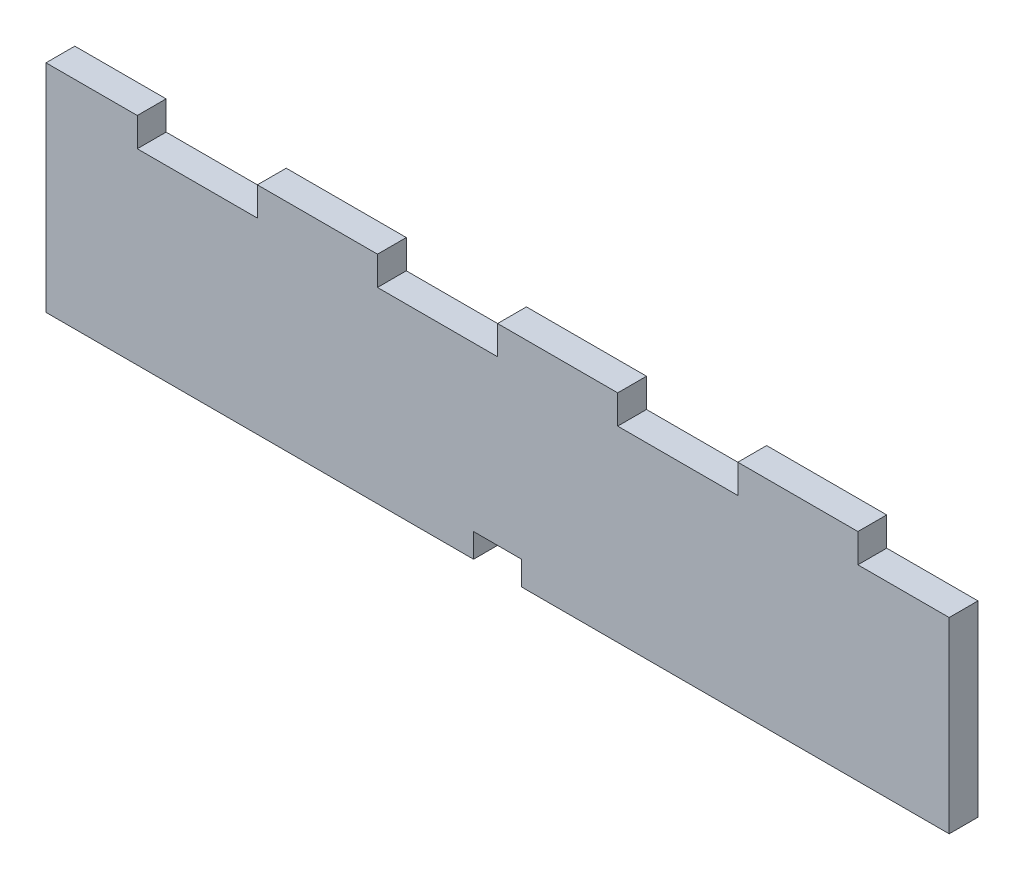
ISO-10303-21;
HEADER;
FILE_DESCRIPTION(('STEP AP214'),'2;1');
FILE_NAME('part.step','',(''),(''),'','','');
FILE_SCHEMA(('AUTOMOTIVE_DESIGN { 1 0 10303 214 1 1 1 1 }'));
ENDSEC;
DATA;
#1=APPLICATION_CONTEXT('core data for automotive mechanical design processes');
#2=APPLICATION_PROTOCOL_DEFINITION('international standard','automotive_design',2000,#1);
#3=PRODUCT_CONTEXT('',#1,'mechanical');
#4=PRODUCT('Part','Part','',(#3));
#5=PRODUCT_RELATED_PRODUCT_CATEGORY('part','',(#4));
#6=PRODUCT_DEFINITION_FORMATION('','',#4);
#7=PRODUCT_DEFINITION_CONTEXT('part definition',#1,'design');
#8=PRODUCT_DEFINITION('design','',#6,#7);
#9=PRODUCT_DEFINITION_SHAPE('','',#8);
#10=(LENGTH_UNIT() NAMED_UNIT(*) SI_UNIT(.MILLI.,.METRE.));
#11=(NAMED_UNIT(*) PLANE_ANGLE_UNIT() SI_UNIT($,.RADIAN.));
#12=(NAMED_UNIT(*) SI_UNIT($,.STERADIAN.) SOLID_ANGLE_UNIT());
#13=UNCERTAINTY_MEASURE_WITH_UNIT(LENGTH_MEASURE(1.E-05),#10,'distance_accuracy_value','');
#14=(GEOMETRIC_REPRESENTATION_CONTEXT(3) GLOBAL_UNCERTAINTY_ASSIGNED_CONTEXT((#13)) GLOBAL_UNIT_ASSIGNED_CONTEXT((#10,
#11,#12)) REPRESENTATION_CONTEXT('',''));
#15=CARTESIAN_POINT('',(0.,0.,0.));
#16=DIRECTION('',(0.,0.,1.));
#17=DIRECTION('',(1.,0.,0.));
#18=AXIS2_PLACEMENT_3D('',#15,#16,#17);
#19=CARTESIAN_POINT('',(0.,5.,6.));
#20=DIRECTION('',(0.,-1.,0.));
#21=DIRECTION('',(0.,0.,-1.));
#22=AXIS2_PLACEMENT_3D('',#19,#20,#21);
#23=PLANE('',#22);
#24=DIRECTION('',(-1.,0.,0.));
#25=VECTOR('',#24,1.);
#26=CARTESIAN_POINT('',(0.,5.,0.));
#27=LINE('',#26,#25);
#28=CARTESIAN_POINT('',(99.,5.,0.));
#29=VERTEX_POINT('',#28);
#30=CARTESIAN_POINT('',(89.,5.,0.));
#31=VERTEX_POINT('',#30);
#32=EDGE_CURVE('E225',#29,#31,#27,.T.);
#33=ORIENTED_EDGE('',*,*,#32,.F.);
#34=DIRECTION('',(0.,0.,-1.));
#35=VECTOR('',#34,1.);
#36=CARTESIAN_POINT('',(99.,5.,6.));
#37=LINE('',#36,#35);
#38=CARTESIAN_POINT('',(99.,5.,6.));
#39=VERTEX_POINT('',#38);
#40=EDGE_CURVE('E11',#39,#29,#37,.T.);
#41=ORIENTED_EDGE('',*,*,#40,.F.);
#42=DIRECTION('',(-1.,0.,0.));
#43=VECTOR('',#42,1.);
#44=CARTESIAN_POINT('',(0.,5.,6.));
#45=LINE('',#44,#43);
#46=CARTESIAN_POINT('',(89.,5.,6.));
#47=VERTEX_POINT('',#46);
#48=EDGE_CURVE('E308',#39,#47,#45,.T.);
#49=ORIENTED_EDGE('',*,*,#48,.T.);
#50=DIRECTION('',(0.,0.,-1.));
#51=VECTOR('',#50,1.);
#52=CARTESIAN_POINT('',(89.,5.,6.));
#53=LINE('',#52,#51);
#54=EDGE_CURVE('E58',#47,#31,#53,.T.);
#55=ORIENTED_EDGE('',*,*,#54,.T.);
#56=EDGE_LOOP('',(#33,#41,#49,#55));
#57=FACE_BOUND('',#56,.T.);
#58=ADVANCED_FACE('F41',(#57),#23,.T.);
#59=CARTESIAN_POINT('',(99.,0.,6.));
#60=DIRECTION('',(-1.,0.,0.));
#61=DIRECTION('',(0.,0.,1.));
#62=AXIS2_PLACEMENT_3D('',#59,#60,#61);
#63=PLANE('',#62);
#64=DIRECTION('',(0.,1.,0.));
#65=VECTOR('',#64,1.);
#66=CARTESIAN_POINT('',(99.,0.,0.));
#67=LINE('',#66,#65);
#68=CARTESIAN_POINT('',(99.,0.,0.));
#69=VERTEX_POINT('',#68);
#70=EDGE_CURVE('E228',#69,#29,#67,.T.);
#71=ORIENTED_EDGE('',*,*,#70,.F.);
#72=DIRECTION('',(0.,0.,-1.));
#73=VECTOR('',#72,1.);
#74=CARTESIAN_POINT('',(99.,0.,6.));
#75=LINE('',#74,#73);
#76=CARTESIAN_POINT('',(99.,0.,6.));
#77=VERTEX_POINT('',#76);
#78=EDGE_CURVE('E50',#77,#69,#75,.T.);
#79=ORIENTED_EDGE('',*,*,#78,.F.);
#80=DIRECTION('',(0.,1.,0.));
#81=VECTOR('',#80,1.);
#82=CARTESIAN_POINT('',(99.,0.,6.));
#83=LINE('',#82,#81);
#84=EDGE_CURVE('E378',#77,#39,#83,.T.);
#85=ORIENTED_EDGE('',*,*,#84,.T.);
#86=ORIENTED_EDGE('',*,*,#40,.T.);
#87=EDGE_LOOP('',(#71,#79,#85,#86));
#88=FACE_BOUND('',#87,.T.);
#89=ADVANCED_FACE('F377',(#88),#63,.T.);
#90=CARTESIAN_POINT('',(0.,0.,6.));
#91=DIRECTION('',(0.,1.,0.));
#92=DIRECTION('',(0.,0.,1.));
#93=AXIS2_PLACEMENT_3D('',#90,#91,#92);
#94=PLANE('',#93);
#95=DIRECTION('',(1.,0.,0.));
#96=VECTOR('',#95,1.);
#97=CARTESIAN_POINT('',(0.,0.,0.));
#98=LINE('',#97,#96);
#99=CARTESIAN_POINT('',(188.,0.,0.));
#100=VERTEX_POINT('',#99);
#101=EDGE_CURVE('E232',#69,#100,#98,.T.);
#102=ORIENTED_EDGE('',*,*,#101,.T.);
#103=DIRECTION('',(0.,0.,-1.));
#104=VECTOR('',#103,1.);
#105=CARTESIAN_POINT('',(188.,0.,6.));
#106=LINE('',#105,#104);
#107=CARTESIAN_POINT('',(188.,0.,6.));
#108=VERTEX_POINT('',#107);
#109=EDGE_CURVE('E360',#108,#100,#106,.T.);
#110=ORIENTED_EDGE('',*,*,#109,.F.);
#111=DIRECTION('',(1.,0.,0.));
#112=VECTOR('',#111,1.);
#113=CARTESIAN_POINT('',(0.,0.,6.));
#114=LINE('',#113,#112);
#115=EDGE_CURVE('E369',#77,#108,#114,.T.);
#116=ORIENTED_EDGE('',*,*,#115,.F.);
#117=ORIENTED_EDGE('',*,*,#78,.T.);
#118=EDGE_LOOP('',(#102,#110,#116,#117));
#119=FACE_BOUND('',#118,.T.);
#120=ADVANCED_FACE('F367',(#119),#94,.F.);
#121=CARTESIAN_POINT('',(188.,0.,6.));
#122=DIRECTION('',(-1.,0.,0.));
#123=DIRECTION('',(0.,0.,1.));
#124=AXIS2_PLACEMENT_3D('',#121,#122,#123);
#125=PLANE('',#124);
#126=DIRECTION('',(0.,1.,0.));
#127=VECTOR('',#126,1.);
#128=CARTESIAN_POINT('',(188.,0.,0.));
#129=LINE('',#128,#127);
#130=CARTESIAN_POINT('',(188.,39.0000037997371,0.));
#131=VERTEX_POINT('',#130);
#132=EDGE_CURVE('E235',#100,#131,#129,.T.);
#133=ORIENTED_EDGE('',*,*,#132,.T.);
#134=DIRECTION('',(0.,0.,-1.));
#135=VECTOR('',#134,1.);
#136=CARTESIAN_POINT('',(188.,39.0000037997371,6.));
#137=LINE('',#136,#135);
#138=CARTESIAN_POINT('',(188.,39.0000037997371,6.));
#139=VERTEX_POINT('',#138);
#140=EDGE_CURVE('E357',#139,#131,#137,.T.);
#141=ORIENTED_EDGE('',*,*,#140,.F.);
#142=DIRECTION('',(0.,1.,0.));
#143=VECTOR('',#142,1.);
#144=CARTESIAN_POINT('',(188.,0.,6.));
#145=LINE('',#144,#143);
#146=EDGE_CURVE('E675',#108,#139,#145,.T.);
#147=ORIENTED_EDGE('',*,*,#146,.F.);
#148=ORIENTED_EDGE('',*,*,#109,.T.);
#149=EDGE_LOOP('',(#133,#141,#147,#148));
#150=FACE_BOUND('',#149,.T.);
#151=ADVANCED_FACE('F396',(#150),#125,.F.);
#152=CARTESIAN_POINT('',(0.,39.0000037997371,6.));
#153=DIRECTION('',(0.,1.,0.));
#154=DIRECTION('',(0.,0.,1.));
#155=AXIS2_PLACEMENT_3D('',#152,#153,#154);
#156=PLANE('',#155);
#157=DIRECTION('',(1.,0.,0.));
#158=VECTOR('',#157,1.);
#159=CARTESIAN_POINT('',(0.,39.0000037997371,0.));
#160=LINE('',#159,#158);
#161=CARTESIAN_POINT('',(169.,39.0000037997371,0.));
#162=VERTEX_POINT('',#161);
#163=EDGE_CURVE('E239',#162,#131,#160,.T.);
#164=ORIENTED_EDGE('',*,*,#163,.F.);
#165=DIRECTION('',(0.,0.,-1.));
#166=VECTOR('',#165,1.);
#167=CARTESIAN_POINT('',(169.,39.0000037997371,6.));
#168=LINE('',#167,#166);
#169=CARTESIAN_POINT('',(169.,39.0000037997371,6.));
#170=VERTEX_POINT('',#169);
#171=EDGE_CURVE('E354',#170,#162,#168,.T.);
#172=ORIENTED_EDGE('',*,*,#171,.F.);
#173=DIRECTION('',(1.,0.,0.));
#174=VECTOR('',#173,1.);
#175=CARTESIAN_POINT('',(0.,39.0000037997371,6.));
#176=LINE('',#175,#174);
#177=EDGE_CURVE('E672',#170,#139,#176,.T.);
#178=ORIENTED_EDGE('',*,*,#177,.T.);
#179=ORIENTED_EDGE('',*,*,#140,.T.);
#180=EDGE_LOOP('',(#164,#172,#178,#179));
#181=FACE_BOUND('',#180,.T.);
#182=ADVANCED_FACE('F401',(#181),#156,.T.);
#183=CARTESIAN_POINT('',(169.,0.,6.));
#184=DIRECTION('',(-1.,0.,0.));
#185=DIRECTION('',(0.,0.,1.));
#186=AXIS2_PLACEMENT_3D('',#183,#184,#185);
#187=PLANE('',#186);
#188=DIRECTION('',(0.,1.,0.));
#189=VECTOR('',#188,1.);
#190=CARTESIAN_POINT('',(169.,0.,0.));
#191=LINE('',#190,#189);
#192=CARTESIAN_POINT('',(169.,45.0000037997371,0.));
#193=VERTEX_POINT('',#192);
#194=EDGE_CURVE('E243',#162,#193,#191,.T.);
#195=ORIENTED_EDGE('',*,*,#194,.T.);
#196=DIRECTION('',(0.,0.,-1.));
#197=VECTOR('',#196,1.);
#198=CARTESIAN_POINT('',(169.,45.0000037997371,6.));
#199=LINE('',#198,#197);
#200=CARTESIAN_POINT('',(169.,45.0000037997371,6.));
#201=VERTEX_POINT('',#200);
#202=EDGE_CURVE('E351',#201,#193,#199,.T.);
#203=ORIENTED_EDGE('',*,*,#202,.F.);
#204=DIRECTION('',(0.,1.,0.));
#205=VECTOR('',#204,1.);
#206=CARTESIAN_POINT('',(169.,0.,6.));
#207=LINE('',#206,#205);
#208=EDGE_CURVE('E669',#170,#201,#207,.T.);
#209=ORIENTED_EDGE('',*,*,#208,.F.);
#210=ORIENTED_EDGE('',*,*,#171,.T.);
#211=EDGE_LOOP('',(#195,#203,#209,#210));
#212=FACE_BOUND('',#211,.T.);
#213=ADVANCED_FACE('F405',(#212),#187,.F.);
#214=CARTESIAN_POINT('',(0.,45.0000037997371,6.));
#215=DIRECTION('',(0.,1.,0.));
#216=DIRECTION('',(0.,0.,1.));
#217=AXIS2_PLACEMENT_3D('',#214,#215,#216);
#218=PLANE('',#217);
#219=DIRECTION('',(1.,0.,0.));
#220=VECTOR('',#219,1.);
#221=CARTESIAN_POINT('',(0.,45.0000037997371,0.));
#222=LINE('',#221,#220);
#223=CARTESIAN_POINT('',(144.,45.0000037997371,0.));
#224=VERTEX_POINT('',#223);
#225=EDGE_CURVE('E247',#224,#193,#222,.T.);
#226=ORIENTED_EDGE('',*,*,#225,.F.);
#227=DIRECTION('',(0.,0.,-1.));
#228=VECTOR('',#227,1.);
#229=CARTESIAN_POINT('',(144.,45.0000037997371,6.));
#230=LINE('',#229,#228);
#231=CARTESIAN_POINT('',(144.,45.0000037997371,6.));
#232=VERTEX_POINT('',#231);
#233=EDGE_CURVE('E348',#232,#224,#230,.T.);
#234=ORIENTED_EDGE('',*,*,#233,.F.);
#235=DIRECTION('',(1.,0.,0.));
#236=VECTOR('',#235,1.);
#237=CARTESIAN_POINT('',(0.,45.0000037997371,6.));
#238=LINE('',#237,#236);
#239=EDGE_CURVE('E667',#232,#201,#238,.T.);
#240=ORIENTED_EDGE('',*,*,#239,.T.);
#241=ORIENTED_EDGE('',*,*,#202,.T.);
#242=EDGE_LOOP('',(#226,#234,#240,#241));
#243=FACE_BOUND('',#242,.T.);
#244=ADVANCED_FACE('F409',(#243),#218,.T.);
#245=CARTESIAN_POINT('',(144.,0.,6.));
#246=DIRECTION('',(-1.,0.,0.));
#247=DIRECTION('',(0.,0.,1.));
#248=AXIS2_PLACEMENT_3D('',#245,#246,#247);
#249=PLANE('',#248);
#250=DIRECTION('',(0.,1.,0.));
#251=VECTOR('',#250,1.);
#252=CARTESIAN_POINT('',(144.,0.,0.));
#253=LINE('',#252,#251);
#254=CARTESIAN_POINT('',(144.,39.0000037997371,0.));
#255=VERTEX_POINT('',#254);
#256=EDGE_CURVE('E251',#255,#224,#253,.T.);
#257=ORIENTED_EDGE('',*,*,#256,.F.);
#258=DIRECTION('',(0.,0.,-1.));
#259=VECTOR('',#258,1.);
#260=CARTESIAN_POINT('',(144.,39.0000037997371,6.));
#261=LINE('',#260,#259);
#262=CARTESIAN_POINT('',(144.,39.0000037997371,6.));
#263=VERTEX_POINT('',#262);
#264=EDGE_CURVE('E345',#263,#255,#261,.T.);
#265=ORIENTED_EDGE('',*,*,#264,.F.);
#266=DIRECTION('',(0.,1.,0.));
#267=VECTOR('',#266,1.);
#268=CARTESIAN_POINT('',(144.,0.,6.));
#269=LINE('',#268,#267);
#270=EDGE_CURVE('E688',#263,#232,#269,.T.);
#271=ORIENTED_EDGE('',*,*,#270,.T.);
#272=ORIENTED_EDGE('',*,*,#233,.T.);
#273=EDGE_LOOP('',(#257,#265,#271,#272));
#274=FACE_BOUND('',#273,.T.);
#275=ADVANCED_FACE('F413',(#274),#249,.T.);
#276=CARTESIAN_POINT('',(0.,39.0000037997371,6.));
#277=DIRECTION('',(0.,1.,0.));
#278=DIRECTION('',(0.,0.,1.));
#279=AXIS2_PLACEMENT_3D('',#276,#277,#278);
#280=PLANE('',#279);
#281=DIRECTION('',(1.,0.,0.));
#282=VECTOR('',#281,1.);
#283=CARTESIAN_POINT('',(0.,39.0000037997371,0.));
#284=LINE('',#283,#282);
#285=CARTESIAN_POINT('',(119.,39.0000037997371,0.));
#286=VERTEX_POINT('',#285);
#287=EDGE_CURVE('E255',#286,#255,#284,.T.);
#288=ORIENTED_EDGE('',*,*,#287,.F.);
#289=DIRECTION('',(0.,0.,-1.));
#290=VECTOR('',#289,1.);
#291=CARTESIAN_POINT('',(119.,39.0000037997371,6.));
#292=LINE('',#291,#290);
#293=CARTESIAN_POINT('',(119.,39.0000037997371,6.));
#294=VERTEX_POINT('',#293);
#295=EDGE_CURVE('E342',#294,#286,#292,.T.);
#296=ORIENTED_EDGE('',*,*,#295,.F.);
#297=DIRECTION('',(1.,0.,0.));
#298=VECTOR('',#297,1.);
#299=CARTESIAN_POINT('',(0.,39.0000037997371,6.));
#300=LINE('',#299,#298);
#301=EDGE_CURVE('E658',#294,#263,#300,.T.);
#302=ORIENTED_EDGE('',*,*,#301,.T.);
#303=ORIENTED_EDGE('',*,*,#264,.T.);
#304=EDGE_LOOP('',(#288,#296,#302,#303));
#305=FACE_BOUND('',#304,.T.);
#306=ADVANCED_FACE('F417',(#305),#280,.T.);
#307=CARTESIAN_POINT('',(119.,0.,6.));
#308=DIRECTION('',(-1.,0.,0.));
#309=DIRECTION('',(0.,0.,1.));
#310=AXIS2_PLACEMENT_3D('',#307,#308,#309);
#311=PLANE('',#310);
#312=DIRECTION('',(0.,1.,0.));
#313=VECTOR('',#312,1.);
#314=CARTESIAN_POINT('',(119.,0.,0.));
#315=LINE('',#314,#313);
#316=CARTESIAN_POINT('',(119.,45.0000037997371,0.));
#317=VERTEX_POINT('',#316);
#318=EDGE_CURVE('E259',#286,#317,#315,.T.);
#319=ORIENTED_EDGE('',*,*,#318,.T.);
#320=DIRECTION('',(0.,0.,-1.));
#321=VECTOR('',#320,1.);
#322=CARTESIAN_POINT('',(119.,45.0000037997371,6.));
#323=LINE('',#322,#321);
#324=CARTESIAN_POINT('',(119.,45.0000037997371,6.));
#325=VERTEX_POINT('',#324);
#326=EDGE_CURVE('E339',#325,#317,#323,.T.);
#327=ORIENTED_EDGE('',*,*,#326,.F.);
#328=DIRECTION('',(0.,1.,0.));
#329=VECTOR('',#328,1.);
#330=CARTESIAN_POINT('',(119.,0.,6.));
#331=LINE('',#330,#329);
#332=EDGE_CURVE('E693',#294,#325,#331,.T.);
#333=ORIENTED_EDGE('',*,*,#332,.F.);
#334=ORIENTED_EDGE('',*,*,#295,.T.);
#335=EDGE_LOOP('',(#319,#327,#333,#334));
#336=FACE_BOUND('',#335,.T.);
#337=ADVANCED_FACE('F421',(#336),#311,.F.);
#338=CARTESIAN_POINT('',(0.,45.0000037997371,6.));
#339=DIRECTION('',(0.,1.,0.));
#340=DIRECTION('',(0.,0.,1.));
#341=AXIS2_PLACEMENT_3D('',#338,#339,#340);
#342=PLANE('',#341);
#343=DIRECTION('',(1.,0.,0.));
#344=VECTOR('',#343,1.);
#345=CARTESIAN_POINT('',(0.,45.0000037997371,0.));
#346=LINE('',#345,#344);
#347=CARTESIAN_POINT('',(94.,45.0000037997371,0.));
#348=VERTEX_POINT('',#347);
#349=EDGE_CURVE('E263',#348,#317,#346,.T.);
#350=ORIENTED_EDGE('',*,*,#349,.F.);
#351=DIRECTION('',(0.,0.,-1.));
#352=VECTOR('',#351,1.);
#353=CARTESIAN_POINT('',(94.,45.0000037997371,6.));
#354=LINE('',#353,#352);
#355=CARTESIAN_POINT('',(94.,45.0000037997371,6.));
#356=VERTEX_POINT('',#355);
#357=EDGE_CURVE('E336',#356,#348,#354,.T.);
#358=ORIENTED_EDGE('',*,*,#357,.F.);
#359=DIRECTION('',(1.,0.,0.));
#360=VECTOR('',#359,1.);
#361=CARTESIAN_POINT('',(0.,45.0000037997371,6.));
#362=LINE('',#361,#360);
#363=EDGE_CURVE('E652',#356,#325,#362,.T.);
#364=ORIENTED_EDGE('',*,*,#363,.T.);
#365=ORIENTED_EDGE('',*,*,#326,.T.);
#366=EDGE_LOOP('',(#350,#358,#364,#365));
#367=FACE_BOUND('',#366,.T.);
#368=ADVANCED_FACE('F425',(#367),#342,.T.);
#369=CARTESIAN_POINT('',(94.,0.,6.));
#370=DIRECTION('',(-1.,0.,0.));
#371=DIRECTION('',(0.,0.,1.));
#372=AXIS2_PLACEMENT_3D('',#369,#370,#371);
#373=PLANE('',#372);
#374=DIRECTION('',(0.,1.,0.));
#375=VECTOR('',#374,1.);
#376=CARTESIAN_POINT('',(94.,0.,0.));
#377=LINE('',#376,#375);
#378=CARTESIAN_POINT('',(94.,39.0000037997371,0.));
#379=VERTEX_POINT('',#378);
#380=EDGE_CURVE('E267',#379,#348,#377,.T.);
#381=ORIENTED_EDGE('',*,*,#380,.F.);
#382=DIRECTION('',(0.,0.,-1.));
#383=VECTOR('',#382,1.);
#384=CARTESIAN_POINT('',(94.,39.0000037997371,6.));
#385=LINE('',#384,#383);
#386=CARTESIAN_POINT('',(94.,39.0000037997371,6.));
#387=VERTEX_POINT('',#386);
#388=EDGE_CURVE('E333',#387,#379,#385,.T.);
#389=ORIENTED_EDGE('',*,*,#388,.F.);
#390=DIRECTION('',(0.,1.,0.));
#391=VECTOR('',#390,1.);
#392=CARTESIAN_POINT('',(94.,0.,6.));
#393=LINE('',#392,#391);
#394=EDGE_CURVE('E648',#387,#356,#393,.T.);
#395=ORIENTED_EDGE('',*,*,#394,.T.);
#396=ORIENTED_EDGE('',*,*,#357,.T.);
#397=EDGE_LOOP('',(#381,#389,#395,#396));
#398=FACE_BOUND('',#397,.T.);
#399=ADVANCED_FACE('F429',(#398),#373,.T.);
#400=CARTESIAN_POINT('',(0.,39.0000037997371,6.));
#401=DIRECTION('',(0.,1.,0.));
#402=DIRECTION('',(0.,0.,1.));
#403=AXIS2_PLACEMENT_3D('',#400,#401,#402);
#404=PLANE('',#403);
#405=DIRECTION('',(1.,0.,0.));
#406=VECTOR('',#405,1.);
#407=CARTESIAN_POINT('',(0.,39.0000037997371,0.));
#408=LINE('',#407,#406);
#409=CARTESIAN_POINT('',(69.,39.0000037997371,0.));
#410=VERTEX_POINT('',#409);
#411=EDGE_CURVE('E271',#410,#379,#408,.T.);
#412=ORIENTED_EDGE('',*,*,#411,.F.);
#413=DIRECTION('',(0.,0.,-1.));
#414=VECTOR('',#413,1.);
#415=CARTESIAN_POINT('',(69.,39.0000037997371,6.));
#416=LINE('',#415,#414);
#417=CARTESIAN_POINT('',(69.,39.0000037997371,6.));
#418=VERTEX_POINT('',#417);
#419=EDGE_CURVE('E330',#418,#410,#416,.T.);
#420=ORIENTED_EDGE('',*,*,#419,.F.);
#421=DIRECTION('',(1.,0.,0.));
#422=VECTOR('',#421,1.);
#423=CARTESIAN_POINT('',(0.,39.0000037997371,6.));
#424=LINE('',#423,#422);
#425=EDGE_CURVE('E642',#418,#387,#424,.T.);
#426=ORIENTED_EDGE('',*,*,#425,.T.);
#427=ORIENTED_EDGE('',*,*,#388,.T.);
#428=EDGE_LOOP('',(#412,#420,#426,#427));
#429=FACE_BOUND('',#428,.T.);
#430=ADVANCED_FACE('F433',(#429),#404,.T.);
#431=CARTESIAN_POINT('',(69.,0.,6.));
#432=DIRECTION('',(-1.,0.,0.));
#433=DIRECTION('',(0.,0.,1.));
#434=AXIS2_PLACEMENT_3D('',#431,#432,#433);
#435=PLANE('',#434);
#436=DIRECTION('',(0.,1.,0.));
#437=VECTOR('',#436,1.);
#438=CARTESIAN_POINT('',(69.,0.,0.));
#439=LINE('',#438,#437);
#440=CARTESIAN_POINT('',(69.,45.0000037997371,0.));
#441=VERTEX_POINT('',#440);
#442=EDGE_CURVE('E275',#410,#441,#439,.T.);
#443=ORIENTED_EDGE('',*,*,#442,.T.);
#444=DIRECTION('',(0.,0.,-1.));
#445=VECTOR('',#444,1.);
#446=CARTESIAN_POINT('',(69.,45.0000037997371,6.));
#447=LINE('',#446,#445);
#448=CARTESIAN_POINT('',(69.,45.0000037997371,6.));
#449=VERTEX_POINT('',#448);
#450=EDGE_CURVE('E327',#449,#441,#447,.T.);
#451=ORIENTED_EDGE('',*,*,#450,.F.);
#452=DIRECTION('',(0.,1.,0.));
#453=VECTOR('',#452,1.);
#454=CARTESIAN_POINT('',(69.,0.,6.));
#455=LINE('',#454,#453);
#456=EDGE_CURVE('E639',#418,#449,#455,.T.);
#457=ORIENTED_EDGE('',*,*,#456,.F.);
#458=ORIENTED_EDGE('',*,*,#419,.T.);
#459=EDGE_LOOP('',(#443,#451,#457,#458));
#460=FACE_BOUND('',#459,.T.);
#461=ADVANCED_FACE('F437',(#460),#435,.F.);
#462=CARTESIAN_POINT('',(0.,45.0000037997371,6.));
#463=DIRECTION('',(0.,1.,0.));
#464=DIRECTION('',(0.,0.,1.));
#465=AXIS2_PLACEMENT_3D('',#462,#463,#464);
#466=PLANE('',#465);
#467=DIRECTION('',(1.,0.,0.));
#468=VECTOR('',#467,1.);
#469=CARTESIAN_POINT('',(0.,45.0000037997371,0.));
#470=LINE('',#469,#468);
#471=CARTESIAN_POINT('',(44.,45.0000037997371,0.));
#472=VERTEX_POINT('',#471);
#473=EDGE_CURVE('E279',#472,#441,#470,.T.);
#474=ORIENTED_EDGE('',*,*,#473,.F.);
#475=DIRECTION('',(0.,0.,-1.));
#476=VECTOR('',#475,1.);
#477=CARTESIAN_POINT('',(44.,45.0000037997371,6.));
#478=LINE('',#477,#476);
#479=CARTESIAN_POINT('',(44.,45.0000037997371,6.));
#480=VERTEX_POINT('',#479);
#481=EDGE_CURVE('E324',#480,#472,#478,.T.);
#482=ORIENTED_EDGE('',*,*,#481,.F.);
#483=DIRECTION('',(1.,0.,0.));
#484=VECTOR('',#483,1.);
#485=CARTESIAN_POINT('',(0.,45.0000037997371,6.));
#486=LINE('',#485,#484);
#487=EDGE_CURVE('E637',#480,#449,#486,.T.);
#488=ORIENTED_EDGE('',*,*,#487,.T.);
#489=ORIENTED_EDGE('',*,*,#450,.T.);
#490=EDGE_LOOP('',(#474,#482,#488,#489));
#491=FACE_BOUND('',#490,.T.);
#492=ADVANCED_FACE('F441',(#491),#466,.T.);
#493=CARTESIAN_POINT('',(44.,0.,6.));
#494=DIRECTION('',(-1.,0.,0.));
#495=DIRECTION('',(0.,0.,1.));
#496=AXIS2_PLACEMENT_3D('',#493,#494,#495);
#497=PLANE('',#496);
#498=DIRECTION('',(0.,1.,0.));
#499=VECTOR('',#498,1.);
#500=CARTESIAN_POINT('',(44.,0.,0.));
#501=LINE('',#500,#499);
#502=CARTESIAN_POINT('',(44.,39.0000037997371,0.));
#503=VERTEX_POINT('',#502);
#504=EDGE_CURVE('E283',#503,#472,#501,.T.);
#505=ORIENTED_EDGE('',*,*,#504,.F.);
#506=DIRECTION('',(0.,0.,-1.));
#507=VECTOR('',#506,1.);
#508=CARTESIAN_POINT('',(44.,39.0000037997371,6.));
#509=LINE('',#508,#507);
#510=CARTESIAN_POINT('',(44.,39.0000037997371,6.));
#511=VERTEX_POINT('',#510);
#512=EDGE_CURVE('E321',#511,#503,#509,.T.);
#513=ORIENTED_EDGE('',*,*,#512,.F.);
#514=DIRECTION('',(0.,1.,0.));
#515=VECTOR('',#514,1.);
#516=CARTESIAN_POINT('',(44.,0.,6.));
#517=LINE('',#516,#515);
#518=EDGE_CURVE('E706',#511,#480,#517,.T.);
#519=ORIENTED_EDGE('',*,*,#518,.T.);
#520=ORIENTED_EDGE('',*,*,#481,.T.);
#521=EDGE_LOOP('',(#505,#513,#519,#520));
#522=FACE_BOUND('',#521,.T.);
#523=ADVANCED_FACE('F445',(#522),#497,.T.);
#524=CARTESIAN_POINT('',(0.,39.0000037997371,6.));
#525=DIRECTION('',(0.,1.,0.));
#526=DIRECTION('',(0.,0.,1.));
#527=AXIS2_PLACEMENT_3D('',#524,#525,#526);
#528=PLANE('',#527);
#529=DIRECTION('',(1.,0.,0.));
#530=VECTOR('',#529,1.);
#531=CARTESIAN_POINT('',(0.,39.0000037997371,0.));
#532=LINE('',#531,#530);
#533=CARTESIAN_POINT('',(19.,39.0000037997371,0.));
#534=VERTEX_POINT('',#533);
#535=EDGE_CURVE('E287',#534,#503,#532,.T.);
#536=ORIENTED_EDGE('',*,*,#535,.F.);
#537=DIRECTION('',(0.,0.,-1.));
#538=VECTOR('',#537,1.);
#539=CARTESIAN_POINT('',(19.,39.0000037997371,6.));
#540=LINE('',#539,#538);
#541=CARTESIAN_POINT('',(19.,39.0000037997371,6.));
#542=VERTEX_POINT('',#541);
#543=EDGE_CURVE('E318',#542,#534,#540,.T.);
#544=ORIENTED_EDGE('',*,*,#543,.F.);
#545=DIRECTION('',(1.,0.,0.));
#546=VECTOR('',#545,1.);
#547=CARTESIAN_POINT('',(0.,39.0000037997371,6.));
#548=LINE('',#547,#546);
#549=EDGE_CURVE('E628',#542,#511,#548,.T.);
#550=ORIENTED_EDGE('',*,*,#549,.T.);
#551=ORIENTED_EDGE('',*,*,#512,.T.);
#552=EDGE_LOOP('',(#536,#544,#550,#551));
#553=FACE_BOUND('',#552,.T.);
#554=ADVANCED_FACE('F449',(#553),#528,.T.);
#555=CARTESIAN_POINT('',(19.,0.,6.));
#556=DIRECTION('',(-1.,0.,0.));
#557=DIRECTION('',(0.,0.,1.));
#558=AXIS2_PLACEMENT_3D('',#555,#556,#557);
#559=PLANE('',#558);
#560=DIRECTION('',(0.,1.,0.));
#561=VECTOR('',#560,1.);
#562=CARTESIAN_POINT('',(19.,0.,0.));
#563=LINE('',#562,#561);
#564=CARTESIAN_POINT('',(19.,45.,0.));
#565=VERTEX_POINT('',#564);
#566=EDGE_CURVE('E291',#534,#565,#563,.T.);
#567=ORIENTED_EDGE('',*,*,#566,.T.);
#568=DIRECTION('',(0.,0.,-1.));
#569=VECTOR('',#568,1.);
#570=CARTESIAN_POINT('',(19.,45.,6.));
#571=LINE('',#570,#569);
#572=CARTESIAN_POINT('',(19.,45.,6.));
#573=VERTEX_POINT('',#572);
#574=EDGE_CURVE('E315',#573,#565,#571,.T.);
#575=ORIENTED_EDGE('',*,*,#574,.F.);
#576=DIRECTION('',(0.,1.,0.));
#577=VECTOR('',#576,1.);
#578=CARTESIAN_POINT('',(19.,0.,6.));
#579=LINE('',#578,#577);
#580=EDGE_CURVE('E219',#542,#573,#579,.T.);
#581=ORIENTED_EDGE('',*,*,#580,.F.);
#582=ORIENTED_EDGE('',*,*,#543,.T.);
#583=EDGE_LOOP('',(#567,#575,#581,#582));
#584=FACE_BOUND('',#583,.T.);
#585=ADVANCED_FACE('F453',(#584),#559,.F.);
#586=CARTESIAN_POINT('',(0.,45.,6.));
#587=DIRECTION('',(0.,1.,0.));
#588=DIRECTION('',(0.,0.,1.));
#589=AXIS2_PLACEMENT_3D('',#586,#587,#588);
#590=PLANE('',#589);
#591=DIRECTION('',(1.,0.,0.));
#592=VECTOR('',#591,1.);
#593=CARTESIAN_POINT('',(0.,45.,0.));
#594=LINE('',#593,#592);
#595=CARTESIAN_POINT('',(0.,45.,0.));
#596=VERTEX_POINT('',#595);
#597=EDGE_CURVE('E295',#596,#565,#594,.T.);
#598=ORIENTED_EDGE('',*,*,#597,.F.);
#599=DIRECTION('',(0.,0.,-1.));
#600=VECTOR('',#599,1.);
#601=CARTESIAN_POINT('',(0.,45.,6.));
#602=LINE('',#601,#600);
#603=CARTESIAN_POINT('',(0.,45.,6.));
#604=VERTEX_POINT('',#603);
#605=EDGE_CURVE('E203',#604,#596,#602,.T.);
#606=ORIENTED_EDGE('',*,*,#605,.F.);
#607=DIRECTION('',(1.,0.,0.));
#608=VECTOR('',#607,1.);
#609=CARTESIAN_POINT('',(0.,45.,6.));
#610=LINE('',#609,#608);
#611=EDGE_CURVE('E215',#604,#573,#610,.T.);
#612=ORIENTED_EDGE('',*,*,#611,.T.);
#613=ORIENTED_EDGE('',*,*,#574,.T.);
#614=EDGE_LOOP('',(#598,#606,#612,#613));
#615=FACE_BOUND('',#614,.T.);
#616=ADVANCED_FACE('F457',(#615),#590,.T.);
#617=CARTESIAN_POINT('',(0.,0.,6.));
#618=DIRECTION('',(-1.,0.,0.));
#619=DIRECTION('',(0.,0.,1.));
#620=AXIS2_PLACEMENT_3D('',#617,#618,#619);
#621=PLANE('',#620);
#622=DIRECTION('',(0.,1.,0.));
#623=VECTOR('',#622,1.);
#624=CARTESIAN_POINT('',(0.,0.,0.));
#625=LINE('',#624,#623);
#626=CARTESIAN_POINT('',(0.,0.,0.));
#627=VERTEX_POINT('',#626);
#628=EDGE_CURVE('E199',#627,#596,#625,.T.);
#629=ORIENTED_EDGE('',*,*,#628,.F.);
#630=DIRECTION('',(0.,0.,-1.));
#631=VECTOR('',#630,1.);
#632=CARTESIAN_POINT('',(0.,0.,6.));
#633=LINE('',#632,#631);
#634=CARTESIAN_POINT('',(0.,0.,6.));
#635=VERTEX_POINT('',#634);
#636=EDGE_CURVE('E193',#635,#627,#633,.T.);
#637=ORIENTED_EDGE('',*,*,#636,.F.);
#638=DIRECTION('',(0.,1.,0.));
#639=VECTOR('',#638,1.);
#640=CARTESIAN_POINT('',(0.,0.,6.));
#641=LINE('',#640,#639);
#642=EDGE_CURVE('E197',#635,#604,#641,.T.);
#643=ORIENTED_EDGE('',*,*,#642,.T.);
#644=ORIENTED_EDGE('',*,*,#605,.T.);
#645=EDGE_LOOP('',(#629,#637,#643,#644));
#646=FACE_BOUND('',#645,.T.);
#647=ADVANCED_FACE('F195',(#646),#621,.T.);
#648=CARTESIAN_POINT('',(0.,0.,6.));
#649=DIRECTION('',(0.,1.,0.));
#650=DIRECTION('',(0.,0.,1.));
#651=AXIS2_PLACEMENT_3D('',#648,#649,#650);
#652=PLANE('',#651);
#653=DIRECTION('',(1.,0.,0.));
#654=VECTOR('',#653,1.);
#655=CARTESIAN_POINT('',(0.,0.,0.));
#656=LINE('',#655,#654);
#657=CARTESIAN_POINT('',(89.,0.,0.));
#658=VERTEX_POINT('',#657);
#659=EDGE_CURVE('E301',#627,#658,#656,.T.);
#660=ORIENTED_EDGE('',*,*,#659,.T.);
#661=DIRECTION('',(0.,0.,-1.));
#662=VECTOR('',#661,1.);
#663=CARTESIAN_POINT('',(89.,0.,6.));
#664=LINE('',#663,#662);
#665=CARTESIAN_POINT('',(89.,0.,6.));
#666=VERTEX_POINT('',#665);
#667=EDGE_CURVE('E126',#666,#658,#664,.T.);
#668=ORIENTED_EDGE('',*,*,#667,.F.);
#669=DIRECTION('',(1.,0.,0.));
#670=VECTOR('',#669,1.);
#671=CARTESIAN_POINT('',(0.,0.,6.));
#672=LINE('',#671,#670);
#673=EDGE_CURVE('E205',#635,#666,#672,.T.);
#674=ORIENTED_EDGE('',*,*,#673,.F.);
#675=ORIENTED_EDGE('',*,*,#636,.T.);
#676=EDGE_LOOP('',(#660,#668,#674,#675));
#677=FACE_BOUND('',#676,.T.);
#678=ADVANCED_FACE('F206',(#677),#652,.F.);
#679=CARTESIAN_POINT('',(89.,0.,6.));
#680=DIRECTION('',(1.,0.,0.));
#681=DIRECTION('',(0.,0.,-1.));
#682=AXIS2_PLACEMENT_3D('',#679,#680,#681);
#683=PLANE('',#682);
#684=DIRECTION('',(0.,-1.,0.));
#685=VECTOR('',#684,1.);
#686=CARTESIAN_POINT('',(89.,0.,0.));
#687=LINE('',#686,#685);
#688=EDGE_CURVE('E304',#31,#658,#687,.T.);
#689=ORIENTED_EDGE('',*,*,#688,.F.);
#690=ORIENTED_EDGE('',*,*,#54,.F.);
#691=DIRECTION('',(0.,-1.,0.));
#692=VECTOR('',#691,1.);
#693=CARTESIAN_POINT('',(89.,0.,6.));
#694=LINE('',#693,#692);
#695=EDGE_CURVE('E210',#47,#666,#694,.T.);
#696=ORIENTED_EDGE('',*,*,#695,.T.);
#697=ORIENTED_EDGE('',*,*,#667,.T.);
#698=EDGE_LOOP('',(#689,#690,#696,#697));
#699=FACE_BOUND('',#698,.T.);
#700=ADVANCED_FACE('F379',(#699),#683,.T.);
#701=CARTESIAN_POINT('',(0.,0.,6.));
#702=DIRECTION('',(0.,0.,1.));
#703=DIRECTION('',(1.,0.,0.));
#704=AXIS2_PLACEMENT_3D('',#701,#702,#703);
#705=PLANE('',#704);
#706=ORIENTED_EDGE('',*,*,#48,.F.);
#707=ORIENTED_EDGE('',*,*,#84,.F.);
#708=ORIENTED_EDGE('',*,*,#115,.T.);
#709=ORIENTED_EDGE('',*,*,#146,.T.);
#710=ORIENTED_EDGE('',*,*,#177,.F.);
#711=ORIENTED_EDGE('',*,*,#208,.T.);
#712=ORIENTED_EDGE('',*,*,#239,.F.);
#713=ORIENTED_EDGE('',*,*,#270,.F.);
#714=ORIENTED_EDGE('',*,*,#301,.F.);
#715=ORIENTED_EDGE('',*,*,#332,.T.);
#716=ORIENTED_EDGE('',*,*,#363,.F.);
#717=ORIENTED_EDGE('',*,*,#394,.F.);
#718=ORIENTED_EDGE('',*,*,#425,.F.);
#719=ORIENTED_EDGE('',*,*,#456,.T.);
#720=ORIENTED_EDGE('',*,*,#487,.F.);
#721=ORIENTED_EDGE('',*,*,#518,.F.);
#722=ORIENTED_EDGE('',*,*,#549,.F.);
#723=ORIENTED_EDGE('',*,*,#580,.T.);
#724=ORIENTED_EDGE('',*,*,#611,.F.);
#725=ORIENTED_EDGE('',*,*,#642,.F.);
#726=ORIENTED_EDGE('',*,*,#673,.T.);
#727=ORIENTED_EDGE('',*,*,#695,.F.);
#728=EDGE_LOOP('',(#706,#707,#708,#709,#710,#711,#712,#713,#714,#715,#716,#717,#718,#719,#720,
#721,#722,#723,#724,#725,#726,#727));
#729=FACE_BOUND('',#728,.T.);
#730=ADVANCED_FACE('F213',(#729),#705,.T.);
#731=CARTESIAN_POINT('',(0.,0.,0.));
#732=DIRECTION('',(0.,0.,1.));
#733=DIRECTION('',(1.,0.,0.));
#734=AXIS2_PLACEMENT_3D('',#731,#732,#733);
#735=PLANE('',#734);
#736=ORIENTED_EDGE('',*,*,#32,.T.);
#737=ORIENTED_EDGE('',*,*,#688,.T.);
#738=ORIENTED_EDGE('',*,*,#659,.F.);
#739=ORIENTED_EDGE('',*,*,#628,.T.);
#740=ORIENTED_EDGE('',*,*,#597,.T.);
#741=ORIENTED_EDGE('',*,*,#566,.F.);
#742=ORIENTED_EDGE('',*,*,#535,.T.);
#743=ORIENTED_EDGE('',*,*,#504,.T.);
#744=ORIENTED_EDGE('',*,*,#473,.T.);
#745=ORIENTED_EDGE('',*,*,#442,.F.);
#746=ORIENTED_EDGE('',*,*,#411,.T.);
#747=ORIENTED_EDGE('',*,*,#380,.T.);
#748=ORIENTED_EDGE('',*,*,#349,.T.);
#749=ORIENTED_EDGE('',*,*,#318,.F.);
#750=ORIENTED_EDGE('',*,*,#287,.T.);
#751=ORIENTED_EDGE('',*,*,#256,.T.);
#752=ORIENTED_EDGE('',*,*,#225,.T.);
#753=ORIENTED_EDGE('',*,*,#194,.F.);
#754=ORIENTED_EDGE('',*,*,#163,.T.);
#755=ORIENTED_EDGE('',*,*,#132,.F.);
#756=ORIENTED_EDGE('',*,*,#101,.F.);
#757=ORIENTED_EDGE('',*,*,#70,.T.);
#758=EDGE_LOOP('',(#736,#737,#738,#739,#740,#741,#742,#743,#744,#745,#746,#747,#748,#749,#750,
#751,#752,#753,#754,#755,#756,#757));
#759=FACE_BOUND('',#758,.T.);
#760=ADVANCED_FACE('F376',(#759),#735,.F.);
#761=CLOSED_SHELL('',(#58,#89,#120,#151,#182,#213,#244,#275,#306,#337,#368,#399,#430,#461,#492,
#523,#554,#585,#616,#647,#678,#700,#730,#760));
#762=MANIFOLD_SOLID_BREP('B2',#761);
#763=ADVANCED_BREP_SHAPE_REPRESENTATION('',(#18,#762),#14);
#764=SHAPE_DEFINITION_REPRESENTATION(#9,#763);
ENDSEC;
END-ISO-10303-21;
